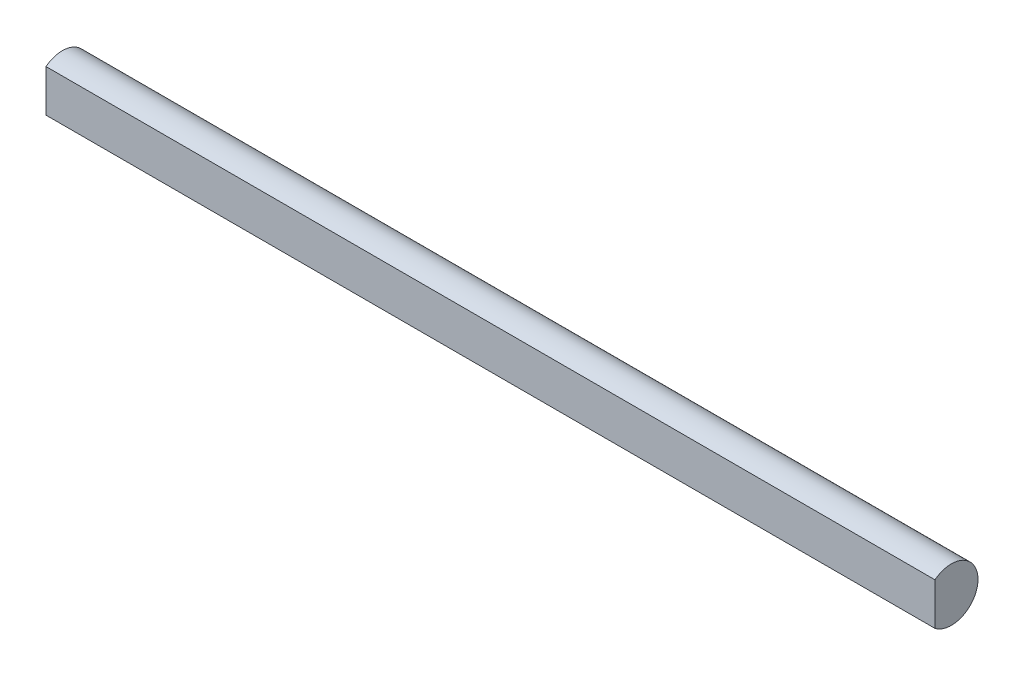
ISO-10303-21;
HEADER;
FILE_DESCRIPTION(('STEP AP214'),'2;1');
FILE_NAME('part.step','',(''),(''),'','','');
FILE_SCHEMA(('AUTOMOTIVE_DESIGN { 1 0 10303 214 1 1 1 1 }'));
ENDSEC;
DATA;
#1=APPLICATION_CONTEXT('core data for automotive mechanical design processes');
#2=APPLICATION_PROTOCOL_DEFINITION('international standard','automotive_design',2000,#1);
#3=PRODUCT_CONTEXT('',#1,'mechanical');
#4=PRODUCT('Part','Part','',(#3));
#5=PRODUCT_RELATED_PRODUCT_CATEGORY('part','',(#4));
#6=PRODUCT_DEFINITION_FORMATION('','',#4);
#7=PRODUCT_DEFINITION_CONTEXT('part definition',#1,'design');
#8=PRODUCT_DEFINITION('design','',#6,#7);
#9=PRODUCT_DEFINITION_SHAPE('','',#8);
#10=(LENGTH_UNIT() NAMED_UNIT(*) SI_UNIT(.MILLI.,.METRE.));
#11=(NAMED_UNIT(*) PLANE_ANGLE_UNIT() SI_UNIT($,.RADIAN.));
#12=(NAMED_UNIT(*) SI_UNIT($,.STERADIAN.) SOLID_ANGLE_UNIT());
#13=UNCERTAINTY_MEASURE_WITH_UNIT(LENGTH_MEASURE(1.E-05),#10,'distance_accuracy_value','');
#14=(GEOMETRIC_REPRESENTATION_CONTEXT(3) GLOBAL_UNCERTAINTY_ASSIGNED_CONTEXT((#13)) GLOBAL_UNIT_ASSIGNED_CONTEXT((#10,
#11,#12)) REPRESENTATION_CONTEXT('',''));
#15=CARTESIAN_POINT('',(0.,0.,0.));
#16=DIRECTION('',(0.,0.,1.));
#17=DIRECTION('',(1.,0.,0.));
#18=AXIS2_PLACEMENT_3D('',#15,#16,#17);
#19=CARTESIAN_POINT('',(95.,0.,0.));
#20=DIRECTION('',(-1.,0.,0.));
#21=DIRECTION('',(0.,0.,1.));
#22=AXIS2_PLACEMENT_3D('',#19,#20,#21);
#23=CYLINDRICAL_SURFACE('',#22,2.85);
#24=CARTESIAN_POINT('',(0.,0.,0.));
#25=DIRECTION('',(1.,0.,0.));
#26=DIRECTION('',(0.,0.,-1.));
#27=AXIS2_PLACEMENT_3D('',#24,#25,#26);
#28=CIRCLE('',#27,2.85);
#29=CARTESIAN_POINT('',(0.,-2.25,1.74928556845359));
#30=VERTEX_POINT('',#29);
#31=CARTESIAN_POINT('',(0.,2.25,1.74928556845359));
#32=VERTEX_POINT('',#31);
#33=EDGE_CURVE('E64',#30,#32,#28,.T.);
#34=ORIENTED_EDGE('',*,*,#33,.T.);
#35=DIRECTION('',(-1.,0.,0.));
#36=VECTOR('',#35,1.);
#37=CARTESIAN_POINT('',(95.,2.25,1.74928556845359));
#38=LINE('',#37,#36);
#39=CARTESIAN_POINT('',(95.,2.25,1.74928556845359));
#40=VERTEX_POINT('',#39);
#41=EDGE_CURVE('E11',#40,#32,#38,.T.);
#42=ORIENTED_EDGE('',*,*,#41,.F.);
#43=CARTESIAN_POINT('',(95.,0.,0.));
#44=DIRECTION('',(1.,0.,0.));
#45=DIRECTION('',(0.,0.,-1.));
#46=AXIS2_PLACEMENT_3D('',#43,#44,#45);
#47=CIRCLE('',#46,2.85);
#48=CARTESIAN_POINT('',(95.,-2.25,1.74928556845359));
#49=VERTEX_POINT('',#48);
#50=EDGE_CURVE('E63',#49,#40,#47,.T.);
#51=ORIENTED_EDGE('',*,*,#50,.F.);
#52=DIRECTION('',(-1.,0.,0.));
#53=VECTOR('',#52,1.);
#54=CARTESIAN_POINT('',(95.,-2.25,1.74928556845359));
#55=LINE('',#54,#53);
#56=EDGE_CURVE('E41',#49,#30,#55,.T.);
#57=ORIENTED_EDGE('',*,*,#56,.T.);
#58=EDGE_LOOP('',(#34,#42,#51,#57));
#59=FACE_BOUND('',#58,.T.);
#60=ADVANCED_FACE('F33',(#59),#23,.T.);
#61=CARTESIAN_POINT('',(95.,2.25,1.74928556845359));
#62=DIRECTION('',(0.,0.,-1.));
#63=DIRECTION('',(-1.,0.,0.));
#64=AXIS2_PLACEMENT_3D('',#61,#62,#63);
#65=PLANE('',#64);
#66=DIRECTION('',(0.,-1.,0.));
#67=VECTOR('',#66,1.);
#68=CARTESIAN_POINT('',(0.,2.25,1.74928556845359));
#69=LINE('',#68,#67);
#70=EDGE_CURVE('E56',#32,#30,#69,.T.);
#71=ORIENTED_EDGE('',*,*,#70,.T.);
#72=ORIENTED_EDGE('',*,*,#56,.F.);
#73=DIRECTION('',(0.,-1.,0.));
#74=VECTOR('',#73,1.);
#75=CARTESIAN_POINT('',(95.,2.25,1.74928556845359));
#76=LINE('',#75,#74);
#77=EDGE_CURVE('E48',#40,#49,#76,.T.);
#78=ORIENTED_EDGE('',*,*,#77,.F.);
#79=ORIENTED_EDGE('',*,*,#41,.T.);
#80=EDGE_LOOP('',(#71,#72,#78,#79));
#81=FACE_BOUND('',#80,.T.);
#82=ADVANCED_FACE('F59',(#81),#65,.F.);
#83=CARTESIAN_POINT('',(95.,0.,0.));
#84=DIRECTION('',(1.,0.,0.));
#85=DIRECTION('',(0.,0.,-1.));
#86=AXIS2_PLACEMENT_3D('',#83,#84,#85);
#87=PLANE('',#86);
#88=ORIENTED_EDGE('',*,*,#50,.T.);
#89=ORIENTED_EDGE('',*,*,#77,.T.);
#90=EDGE_LOOP('',(#88,#89));
#91=FACE_BOUND('',#90,.T.);
#92=ADVANCED_FACE('F71',(#91),#87,.T.);
#93=CARTESIAN_POINT('',(0.,0.,0.));
#94=DIRECTION('',(1.,0.,0.));
#95=DIRECTION('',(0.,0.,-1.));
#96=AXIS2_PLACEMENT_3D('',#93,#94,#95);
#97=PLANE('',#96);
#98=ORIENTED_EDGE('',*,*,#33,.F.);
#99=ORIENTED_EDGE('',*,*,#70,.F.);
#100=EDGE_LOOP('',(#98,#99));
#101=FACE_BOUND('',#100,.T.);
#102=ADVANCED_FACE('F67',(#101),#97,.F.);
#103=CLOSED_SHELL('',(#60,#82,#92,#102));
#104=MANIFOLD_SOLID_BREP('B2',#103);
#105=ADVANCED_BREP_SHAPE_REPRESENTATION('',(#18,#104),#14);
#106=SHAPE_DEFINITION_REPRESENTATION(#9,#105);
ENDSEC;
END-ISO-10303-21;
